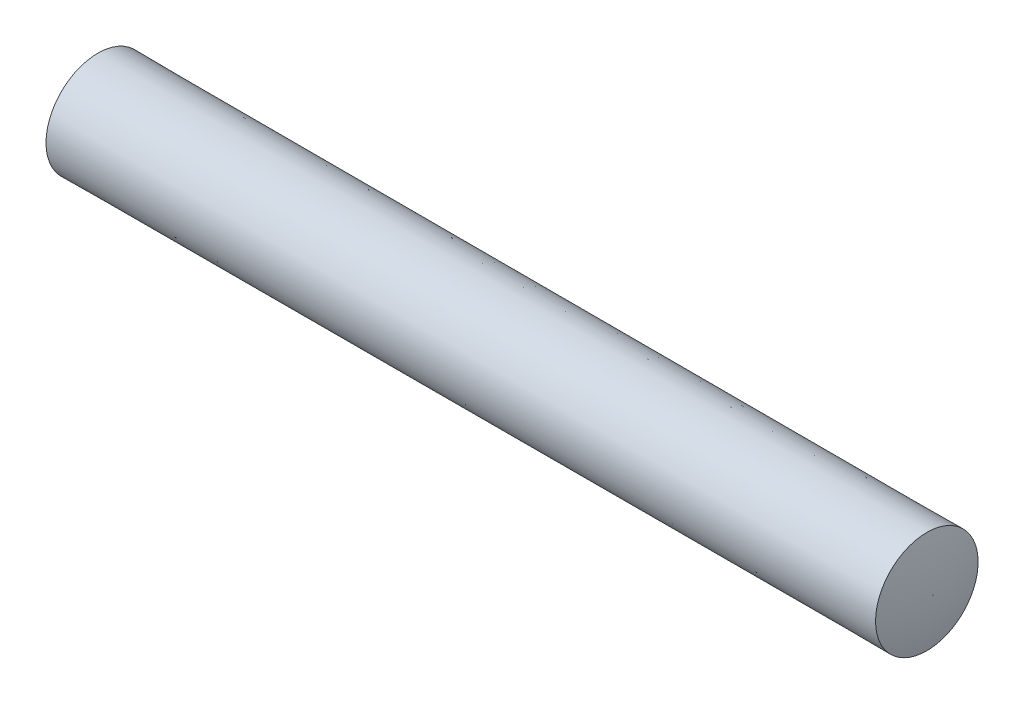
ISO-10303-21;
HEADER;
FILE_DESCRIPTION(('STEP AP214'),'2;1');
FILE_NAME('part.step','',(''),(''),'','','');
FILE_SCHEMA(('AUTOMOTIVE_DESIGN { 1 0 10303 214 1 1 1 1 }'));
ENDSEC;
DATA;
#1=APPLICATION_CONTEXT('core data for automotive mechanical design processes');
#2=APPLICATION_PROTOCOL_DEFINITION('international standard','automotive_design',2000,#1);
#3=PRODUCT_CONTEXT('',#1,'mechanical');
#4=PRODUCT('Part','Part','',(#3));
#5=PRODUCT_RELATED_PRODUCT_CATEGORY('part','',(#4));
#6=PRODUCT_DEFINITION_FORMATION('','',#4);
#7=PRODUCT_DEFINITION_CONTEXT('part definition',#1,'design');
#8=PRODUCT_DEFINITION('design','',#6,#7);
#9=PRODUCT_DEFINITION_SHAPE('','',#8);
#10=(LENGTH_UNIT() NAMED_UNIT(*) SI_UNIT(.MILLI.,.METRE.));
#11=(NAMED_UNIT(*) PLANE_ANGLE_UNIT() SI_UNIT($,.RADIAN.));
#12=(NAMED_UNIT(*) SI_UNIT($,.STERADIAN.) SOLID_ANGLE_UNIT());
#13=UNCERTAINTY_MEASURE_WITH_UNIT(LENGTH_MEASURE(1.E-05),#10,'distance_accuracy_value','');
#14=(GEOMETRIC_REPRESENTATION_CONTEXT(3) GLOBAL_UNCERTAINTY_ASSIGNED_CONTEXT((#13)) GLOBAL_UNIT_ASSIGNED_CONTEXT((#10,
#11,#12)) REPRESENTATION_CONTEXT('',''));
#15=CARTESIAN_POINT('',(0.,0.,0.));
#16=DIRECTION('',(0.,0.,1.));
#17=DIRECTION('',(1.,0.,0.));
#18=AXIS2_PLACEMENT_3D('',#15,#16,#17);
#19=CARTESIAN_POINT('',(12.8954616068837,0.,0.));
#20=DIRECTION('',(-1.,0.,0.));
#21=DIRECTION('',(0.,0.,1.));
#22=AXIS2_PLACEMENT_3D('',#19,#20,#21);
#23=PLANE('',#22);
#24=CARTESIAN_POINT('',(12.8954616068837,0.,0.));
#25=DIRECTION('',(-1.,0.,0.));
#26=DIRECTION('',(0.,0.,1.));
#27=AXIS2_PLACEMENT_3D('',#24,#25,#26);
#28=CIRCLE('',#27,0.00793750000000002);
#29=CARTESIAN_POINT('',(12.8954616068837,0.,0.00793750000000002));
#30=VERTEX_POINT('',#29);
#31=EDGE_CURVE('E10',#30,#30,#28,.T.);
#32=ORIENTED_EDGE('',*,*,#31,.F.);
#33=EDGE_LOOP('',(#32));
#34=FACE_BOUND('',#33,.T.);
#35=ADVANCED_FACE('F31',(#34),#23,.F.);
#36=CARTESIAN_POINT('',(9.72046160688373,0.,0.));
#37=DIRECTION('',(-1.,0.,0.));
#38=DIRECTION('',(0.,0.,1.));
#39=AXIS2_PLACEMENT_3D('',#36,#37,#38);
#40=DEGENERATE_TOROIDAL_SURFACE('',#39,0.00793750000000002,3.175,.T.);
#41=CARTESIAN_POINT('',(12.7987809384175,0.,0.));
#42=DIRECTION('',(-1.,0.,0.));
#43=DIRECTION('',(0.,0.,1.));
#44=AXIS2_PLACEMENT_3D('',#41,#42,#43);
#45=CIRCLE('',#44,0.785481770833333);
#46=CARTESIAN_POINT('',(12.7987809384175,0.,0.785481770833333));
#47=VERTEX_POINT('',#46);
#48=EDGE_CURVE('E37',#47,#47,#45,.T.);
#49=ORIENTED_EDGE('',*,*,#48,.F.);
#50=EDGE_LOOP('',(#49));
#51=FACE_BOUND('',#50,.T.);
#52=ORIENTED_EDGE('',*,*,#31,.T.);
#53=EDGE_LOOP('',(#52));
#54=FACE_BOUND('',#53,.T.);
#55=ADVANCED_FACE('F61',(#51,#54),#40,.T.);
#56=CARTESIAN_POINT('',(12.7987809384175,0.,0.));
#57=DIRECTION('',(-1.,0.,0.));
#58=DIRECTION('',(0.,0.,1.));
#59=AXIS2_PLACEMENT_3D('',#56,#57,#58);
#60=CONICAL_SURFACE('',#59,0.785481770833333,0.00065104157468415);
#61=CARTESIAN_POINT('',(0.0987809384174624,0.,0.));
#62=DIRECTION('',(-1.,0.,0.));
#63=DIRECTION('',(0.,0.,1.));
#64=AXIS2_PLACEMENT_3D('',#61,#62,#63);
#65=CIRCLE('',#64,0.793749999999999);
#66=CARTESIAN_POINT('',(0.0987809384174624,0.,0.793749999999999));
#67=VERTEX_POINT('',#66);
#68=EDGE_CURVE('E41',#67,#67,#65,.T.);
#69=ORIENTED_EDGE('',*,*,#68,.F.);
#70=EDGE_LOOP('',(#69));
#71=FACE_BOUND('',#70,.T.);
#72=ORIENTED_EDGE('',*,*,#48,.T.);
#73=EDGE_LOOP('',(#72));
#74=FACE_BOUND('',#73,.T.);
#75=ADVANCED_FACE('F56',(#71,#74),#60,.T.);
#76=CARTESIAN_POINT('',(3.175,0.,0.));
#77=DIRECTION('',(-1.,0.,0.));
#78=DIRECTION('',(0.,0.,1.));
#79=AXIS2_PLACEMENT_3D('',#76,#77,#78);
#80=DEGENERATE_TOROIDAL_SURFACE('',#79,0.0079375,3.175,.T.);
#81=CARTESIAN_POINT('',(0.,0.,0.));
#82=DIRECTION('',(-1.,0.,0.));
#83=DIRECTION('',(0.,0.,1.));
#84=AXIS2_PLACEMENT_3D('',#81,#82,#83);
#85=CIRCLE('',#84,0.0079375);
#86=CARTESIAN_POINT('',(0.,0.,0.0079375));
#87=VERTEX_POINT('',#86);
#88=EDGE_CURVE('E45',#87,#87,#85,.T.);
#89=ORIENTED_EDGE('',*,*,#88,.F.);
#90=EDGE_LOOP('',(#89));
#91=FACE_BOUND('',#90,.T.);
#92=ORIENTED_EDGE('',*,*,#68,.T.);
#93=EDGE_LOOP('',(#92));
#94=FACE_BOUND('',#93,.T.);
#95=ADVANCED_FACE('F53',(#91,#94),#80,.T.);
#96=CARTESIAN_POINT('',(0.,0.,0.));
#97=DIRECTION('',(1.,0.,0.));
#98=DIRECTION('',(0.,0.,-1.));
#99=AXIS2_PLACEMENT_3D('',#96,#97,#98);
#100=PLANE('',#99);
#101=ORIENTED_EDGE('',*,*,#88,.T.);
#102=EDGE_LOOP('',(#101));
#103=FACE_BOUND('',#102,.T.);
#104=ADVANCED_FACE('F51',(#103),#100,.F.);
#105=CLOSED_SHELL('',(#35,#55,#75,#95,#104));
#106=MANIFOLD_SOLID_BREP('B2',#105);
#107=ADVANCED_BREP_SHAPE_REPRESENTATION('',(#18,#106),#14);
#108=SHAPE_DEFINITION_REPRESENTATION(#9,#107);
ENDSEC;
END-ISO-10303-21;
